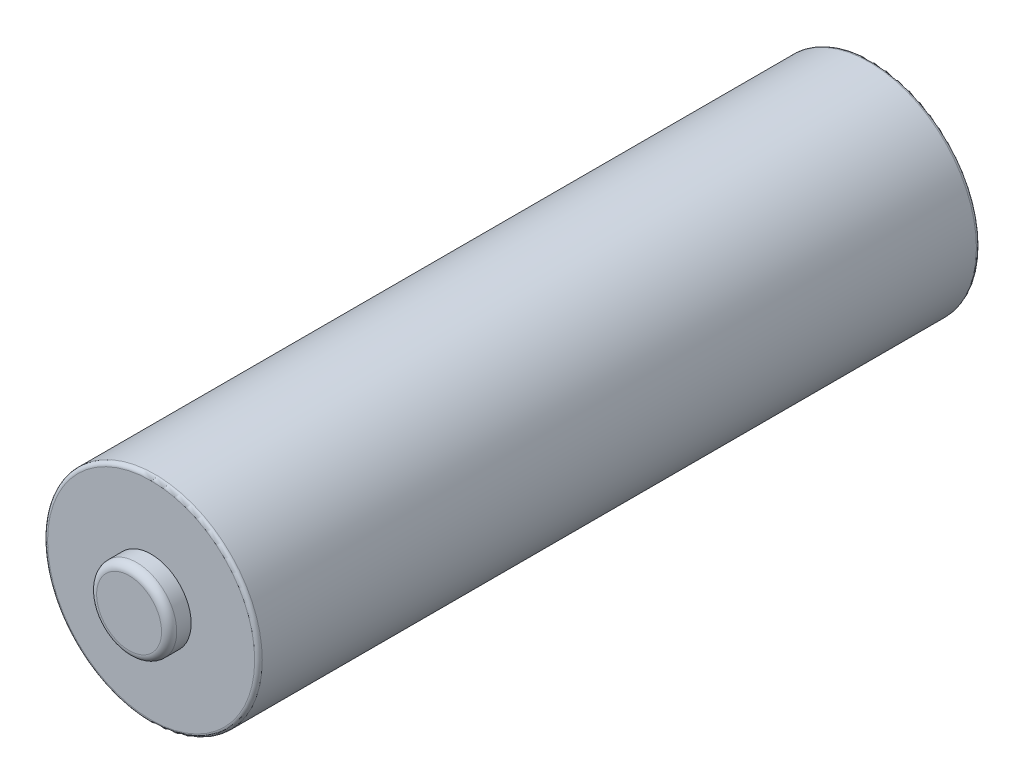
ISO-10303-21;
HEADER;
FILE_DESCRIPTION(('STEP AP214'),'2;1');
FILE_NAME('part.step','',(''),(''),'','','');
FILE_SCHEMA(('AUTOMOTIVE_DESIGN { 1 0 10303 214 1 1 1 1 }'));
ENDSEC;
DATA;
#1=APPLICATION_CONTEXT('core data for automotive mechanical design processes');
#2=APPLICATION_PROTOCOL_DEFINITION('international standard','automotive_design',2000,#1);
#3=PRODUCT_CONTEXT('',#1,'mechanical');
#4=PRODUCT('Part','Part','',(#3));
#5=PRODUCT_RELATED_PRODUCT_CATEGORY('part','',(#4));
#6=PRODUCT_DEFINITION_FORMATION('','',#4);
#7=PRODUCT_DEFINITION_CONTEXT('part definition',#1,'design');
#8=PRODUCT_DEFINITION('design','',#6,#7);
#9=PRODUCT_DEFINITION_SHAPE('','',#8);
#10=(LENGTH_UNIT() NAMED_UNIT(*) SI_UNIT(.MILLI.,.METRE.));
#11=(NAMED_UNIT(*) PLANE_ANGLE_UNIT() SI_UNIT($,.RADIAN.));
#12=(NAMED_UNIT(*) SI_UNIT($,.STERADIAN.) SOLID_ANGLE_UNIT());
#13=UNCERTAINTY_MEASURE_WITH_UNIT(LENGTH_MEASURE(1.E-05),#10,'distance_accuracy_value','');
#14=(GEOMETRIC_REPRESENTATION_CONTEXT(3) GLOBAL_UNCERTAINTY_ASSIGNED_CONTEXT((#13)) GLOBAL_UNIT_ASSIGNED_CONTEXT((#10,
#11,#12)) REPRESENTATION_CONTEXT('',''));
#15=CARTESIAN_POINT('',(0.,0.,0.));
#16=DIRECTION('',(0.,0.,1.));
#17=DIRECTION('',(1.,0.,0.));
#18=AXIS2_PLACEMENT_3D('',#15,#16,#17);
#19=CARTESIAN_POINT('',(0.,0.,47.5));
#20=DIRECTION('',(0.,0.,-1.));
#21=DIRECTION('',(-1.,0.,0.));
#22=AXIS2_PLACEMENT_3D('',#19,#20,#21);
#23=CYLINDRICAL_SURFACE('',#22,7.065);
#24=CARTESIAN_POINT('',(0.,0.,0.25));
#25=DIRECTION('',(0.,0.,1.));
#26=DIRECTION('',(1.,0.,0.));
#27=AXIS2_PLACEMENT_3D('',#24,#25,#26);
#28=CIRCLE('',#27,7.065);
#29=CARTESIAN_POINT('',(7.065,0.,0.25));
#30=VERTEX_POINT('',#29);
#31=EDGE_CURVE('E62',#30,#30,#28,.T.);
#32=ORIENTED_EDGE('',*,*,#31,.T.);
#33=EDGE_LOOP('',(#32));
#34=FACE_BOUND('',#33,.T.);
#35=CARTESIAN_POINT('',(0.,0.,47.25));
#36=DIRECTION('',(0.,0.,1.));
#37=DIRECTION('',(1.,0.,0.));
#38=AXIS2_PLACEMENT_3D('',#35,#36,#37);
#39=CIRCLE('',#38,7.065);
#40=CARTESIAN_POINT('',(7.065,0.,47.25));
#41=VERTEX_POINT('',#40);
#42=EDGE_CURVE('E65',#41,#41,#39,.F.);
#43=ORIENTED_EDGE('',*,*,#42,.T.);
#44=EDGE_LOOP('',(#43));
#45=FACE_BOUND('',#44,.T.);
#46=ADVANCED_FACE('F33',(#34,#45),#23,.T.);
#47=CARTESIAN_POINT('',(0.,0.,47.5));
#48=DIRECTION('',(0.,0.,1.));
#49=DIRECTION('',(1.,0.,0.));
#50=AXIS2_PLACEMENT_3D('',#47,#48,#49);
#51=PLANE('',#50);
#52=CARTESIAN_POINT('',(0.,0.,47.5));
#53=DIRECTION('',(0.,0.,1.));
#54=DIRECTION('',(1.,0.,0.));
#55=AXIS2_PLACEMENT_3D('',#52,#53,#54);
#56=CIRCLE('',#55,6.815);
#57=CARTESIAN_POINT('',(6.815,0.,47.5));
#58=VERTEX_POINT('',#57);
#59=EDGE_CURVE('E56',#58,#58,#56,.T.);
#60=ORIENTED_EDGE('',*,*,#59,.T.);
#61=EDGE_LOOP('',(#60));
#62=FACE_BOUND('',#61,.T.);
#63=CARTESIAN_POINT('',(0.,0.,47.5));
#64=DIRECTION('',(0.,0.,1.));
#65=DIRECTION('',(1.,0.,0.));
#66=AXIS2_PLACEMENT_3D('',#63,#64,#65);
#67=CIRCLE('',#66,2.635);
#68=CARTESIAN_POINT('',(2.635,0.,47.5));
#69=VERTEX_POINT('',#68);
#70=EDGE_CURVE('E68',#69,#69,#67,.T.);
#71=ORIENTED_EDGE('',*,*,#70,.F.);
#72=EDGE_LOOP('',(#71));
#73=FACE_BOUND('',#72,.T.);
#74=ADVANCED_FACE('F74',(#62,#73),#51,.T.);
#75=CARTESIAN_POINT('',(0.,0.,0.));
#76=DIRECTION('',(0.,0.,1.));
#77=DIRECTION('',(1.,0.,0.));
#78=AXIS2_PLACEMENT_3D('',#75,#76,#77);
#79=PLANE('',#78);
#80=CARTESIAN_POINT('',(0.,0.,0.));
#81=DIRECTION('',(0.,0.,1.));
#82=DIRECTION('',(1.,0.,0.));
#83=AXIS2_PLACEMENT_3D('',#80,#81,#82);
#84=CIRCLE('',#83,4.435);
#85=CARTESIAN_POINT('',(4.435,0.,0.));
#86=VERTEX_POINT('',#85);
#87=EDGE_CURVE('E53',#86,#86,#84,.F.);
#88=ORIENTED_EDGE('',*,*,#87,.F.);
#89=EDGE_LOOP('',(#88));
#90=FACE_BOUND('',#89,.T.);
#91=CARTESIAN_POINT('',(0.,0.,0.));
#92=DIRECTION('',(0.,0.,1.));
#93=DIRECTION('',(1.,0.,0.));
#94=AXIS2_PLACEMENT_3D('',#91,#92,#93);
#95=CIRCLE('',#94,6.815);
#96=CARTESIAN_POINT('',(6.815,0.,0.));
#97=VERTEX_POINT('',#96);
#98=EDGE_CURVE('E59',#97,#97,#95,.F.);
#99=ORIENTED_EDGE('',*,*,#98,.T.);
#100=EDGE_LOOP('',(#99));
#101=FACE_BOUND('',#100,.T.);
#102=ADVANCED_FACE('F76',(#90,#101),#79,.F.);
#103=CARTESIAN_POINT('',(0.,0.,48.95));
#104=DIRECTION('',(0.,0.,-1.));
#105=DIRECTION('',(-1.,0.,0.));
#106=AXIS2_PLACEMENT_3D('',#103,#104,#105);
#107=CYLINDRICAL_SURFACE('',#106,2.635);
#108=CARTESIAN_POINT('',(0.,0.,48.45));
#109=DIRECTION('',(0.,0.,1.));
#110=DIRECTION('',(1.,0.,0.));
#111=AXIS2_PLACEMENT_3D('',#108,#109,#110);
#112=CIRCLE('',#111,2.635);
#113=CARTESIAN_POINT('',(2.635,0.,48.45));
#114=VERTEX_POINT('',#113);
#115=EDGE_CURVE('E10',#114,#114,#112,.F.);
#116=ORIENTED_EDGE('',*,*,#115,.T.);
#117=EDGE_LOOP('',(#116));
#118=FACE_BOUND('',#117,.T.);
#119=ORIENTED_EDGE('',*,*,#70,.T.);
#120=EDGE_LOOP('',(#119));
#121=FACE_BOUND('',#120,.T.);
#122=ADVANCED_FACE('F72',(#118,#121),#107,.T.);
#123=CARTESIAN_POINT('',(0.,0.,48.95));
#124=DIRECTION('',(0.,0.,1.));
#125=DIRECTION('',(1.,0.,0.));
#126=AXIS2_PLACEMENT_3D('',#123,#124,#125);
#127=PLANE('',#126);
#128=CARTESIAN_POINT('',(0.,0.,48.95));
#129=DIRECTION('',(0.,0.,1.));
#130=DIRECTION('',(1.,0.,0.));
#131=AXIS2_PLACEMENT_3D('',#128,#129,#130);
#132=CIRCLE('',#131,2.135);
#133=CARTESIAN_POINT('',(2.135,0.,48.95));
#134=VERTEX_POINT('',#133);
#135=EDGE_CURVE('E40',#134,#134,#132,.T.);
#136=ORIENTED_EDGE('',*,*,#135,.T.);
#137=EDGE_LOOP('',(#136));
#138=FACE_BOUND('',#137,.T.);
#139=ADVANCED_FACE('F94',(#138),#127,.T.);
#140=CARTESIAN_POINT('',(0.,0.,0.25));
#141=DIRECTION('',(0.,0.,1.));
#142=DIRECTION('',(1.,0.,0.));
#143=AXIS2_PLACEMENT_3D('',#140,#141,#142);
#144=TOROIDAL_SURFACE('',#143,6.815,0.25);
#145=ORIENTED_EDGE('',*,*,#98,.F.);
#146=EDGE_LOOP('',(#145));
#147=FACE_BOUND('',#146,.T.);
#148=ORIENTED_EDGE('',*,*,#31,.F.);
#149=EDGE_LOOP('',(#148));
#150=FACE_BOUND('',#149,.T.);
#151=ADVANCED_FACE('F90',(#147,#150),#144,.T.);
#152=CARTESIAN_POINT('',(0.,0.,47.25));
#153=DIRECTION('',(0.,0.,1.));
#154=DIRECTION('',(1.,0.,0.));
#155=AXIS2_PLACEMENT_3D('',#152,#153,#154);
#156=TOROIDAL_SURFACE('',#155,6.815,0.25);
#157=ORIENTED_EDGE('',*,*,#42,.F.);
#158=EDGE_LOOP('',(#157));
#159=FACE_BOUND('',#158,.T.);
#160=ORIENTED_EDGE('',*,*,#59,.F.);
#161=EDGE_LOOP('',(#160));
#162=FACE_BOUND('',#161,.T.);
#163=ADVANCED_FACE('F93',(#159,#162),#156,.T.);
#164=CARTESIAN_POINT('',(0.,0.,-1.2));
#165=DIRECTION('',(0.,0.,1.));
#166=DIRECTION('',(1.,0.,0.));
#167=AXIS2_PLACEMENT_3D('',#164,#165,#166);
#168=CYLINDRICAL_SURFACE('',#167,4.435);
#169=CARTESIAN_POINT('',(0.,0.,-0.7));
#170=DIRECTION('',(0.,0.,-1.));
#171=DIRECTION('',(-1.,0.,0.));
#172=AXIS2_PLACEMENT_3D('',#169,#170,#171);
#173=CIRCLE('',#172,4.435);
#174=CARTESIAN_POINT('',(-4.435,0.,-0.7));
#175=VERTEX_POINT('',#174);
#176=EDGE_CURVE('E44',#175,#175,#173,.F.);
#177=ORIENTED_EDGE('',*,*,#176,.T.);
#178=EDGE_LOOP('',(#177));
#179=FACE_BOUND('',#178,.T.);
#180=ORIENTED_EDGE('',*,*,#87,.T.);
#181=EDGE_LOOP('',(#180));
#182=FACE_BOUND('',#181,.T.);
#183=ADVANCED_FACE('F97',(#179,#182),#168,.T.);
#184=CARTESIAN_POINT('',(0.,0.,-1.2));
#185=DIRECTION('',(0.,0.,-1.));
#186=DIRECTION('',(-1.,0.,0.));
#187=AXIS2_PLACEMENT_3D('',#184,#185,#186);
#188=PLANE('',#187);
#189=CARTESIAN_POINT('',(0.,0.,-1.2));
#190=DIRECTION('',(0.,0.,-1.));
#191=DIRECTION('',(-1.,0.,0.));
#192=AXIS2_PLACEMENT_3D('',#189,#190,#191);
#193=CIRCLE('',#192,3.935);
#194=CARTESIAN_POINT('',(-3.935,0.,-1.2));
#195=VERTEX_POINT('',#194);
#196=EDGE_CURVE('E48',#195,#195,#193,.T.);
#197=ORIENTED_EDGE('',*,*,#196,.T.);
#198=EDGE_LOOP('',(#197));
#199=FACE_BOUND('',#198,.T.);
#200=ADVANCED_FACE('F101',(#199),#188,.T.);
#201=CARTESIAN_POINT('',(0.,0.,-0.7));
#202=DIRECTION('',(0.,0.,-1.));
#203=DIRECTION('',(-1.,0.,0.));
#204=AXIS2_PLACEMENT_3D('',#201,#202,#203);
#205=TOROIDAL_SURFACE('',#204,3.935,0.5);
#206=ORIENTED_EDGE('',*,*,#176,.F.);
#207=EDGE_LOOP('',(#206));
#208=FACE_BOUND('',#207,.T.);
#209=ORIENTED_EDGE('',*,*,#196,.F.);
#210=EDGE_LOOP('',(#209));
#211=FACE_BOUND('',#210,.T.);
#212=ADVANCED_FACE('F99',(#208,#211),#205,.T.);
#213=CARTESIAN_POINT('',(0.,0.,48.45));
#214=DIRECTION('',(0.,0.,1.));
#215=DIRECTION('',(1.,0.,0.));
#216=AXIS2_PLACEMENT_3D('',#213,#214,#215);
#217=TOROIDAL_SURFACE('',#216,2.135,0.5);
#218=ORIENTED_EDGE('',*,*,#115,.F.);
#219=EDGE_LOOP('',(#218));
#220=FACE_BOUND('',#219,.T.);
#221=ORIENTED_EDGE('',*,*,#135,.F.);
#222=EDGE_LOOP('',(#221));
#223=FACE_BOUND('',#222,.T.);
#224=ADVANCED_FACE('F35',(#220,#223),#217,.T.);
#225=CLOSED_SHELL('',(#46,#74,#102,#122,#139,#151,#163,#183,#200,#212,#224));
#226=MANIFOLD_SOLID_BREP('B2',#225);
#227=ADVANCED_BREP_SHAPE_REPRESENTATION('',(#18,#226),#14);
#228=SHAPE_DEFINITION_REPRESENTATION(#9,#227);
ENDSEC;
END-ISO-10303-21;
